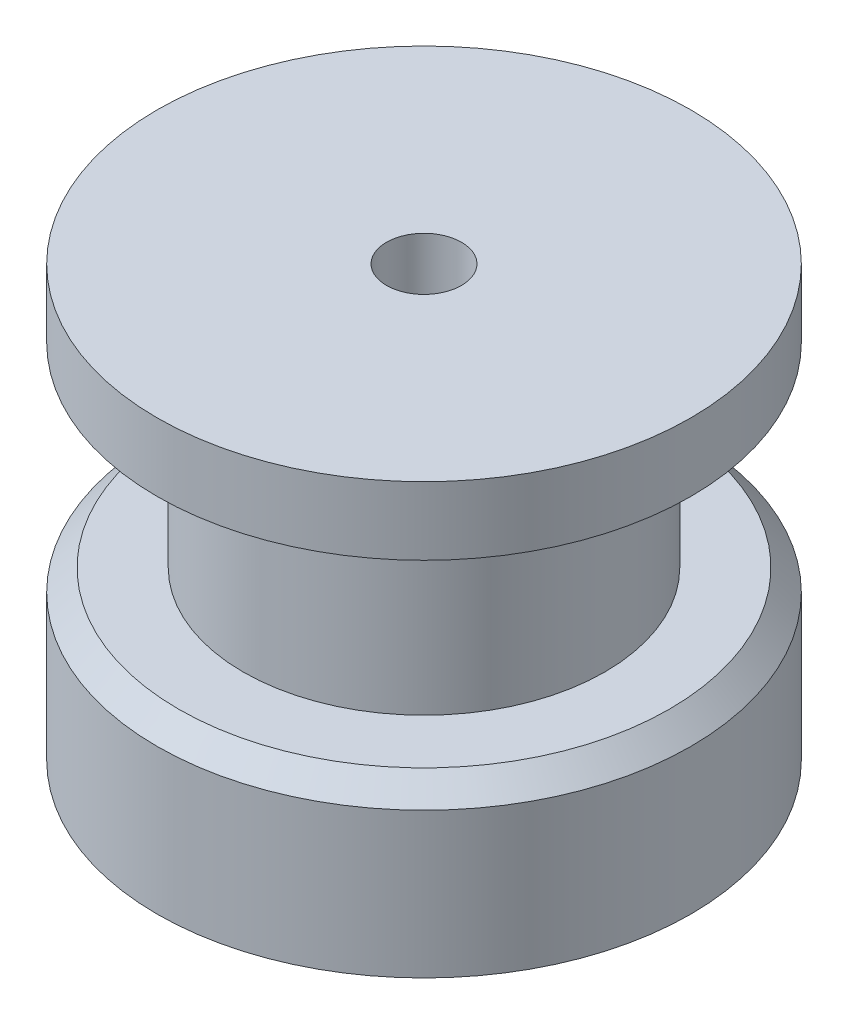
ISO-10303-21;
HEADER;
FILE_DESCRIPTION(('STEP AP214'),'2;1');
FILE_NAME('part.step','',(''),(''),'','','');
FILE_SCHEMA(('AUTOMOTIVE_DESIGN { 1 0 10303 214 1 1 1 1 }'));
ENDSEC;
DATA;
#1=APPLICATION_CONTEXT('core data for automotive mechanical design processes');
#2=APPLICATION_PROTOCOL_DEFINITION('international standard','automotive_design',2000,#1);
#3=PRODUCT_CONTEXT('',#1,'mechanical');
#4=PRODUCT('Part','Part','',(#3));
#5=PRODUCT_RELATED_PRODUCT_CATEGORY('part','',(#4));
#6=PRODUCT_DEFINITION_FORMATION('','',#4);
#7=PRODUCT_DEFINITION_CONTEXT('part definition',#1,'design');
#8=PRODUCT_DEFINITION('design','',#6,#7);
#9=PRODUCT_DEFINITION_SHAPE('','',#8);
#10=(LENGTH_UNIT() NAMED_UNIT(*) SI_UNIT(.MILLI.,.METRE.));
#11=(NAMED_UNIT(*) PLANE_ANGLE_UNIT() SI_UNIT($,.RADIAN.));
#12=(NAMED_UNIT(*) SI_UNIT($,.STERADIAN.) SOLID_ANGLE_UNIT());
#13=UNCERTAINTY_MEASURE_WITH_UNIT(LENGTH_MEASURE(1.E-05),#10,'distance_accuracy_value','');
#14=(GEOMETRIC_REPRESENTATION_CONTEXT(3) GLOBAL_UNCERTAINTY_ASSIGNED_CONTEXT((#13)) GLOBAL_UNIT_ASSIGNED_CONTEXT((#10,
#11,#12)) REPRESENTATION_CONTEXT('',''));
#15=CARTESIAN_POINT('',(0.,0.,0.));
#16=DIRECTION('',(0.,0.,1.));
#17=DIRECTION('',(1.,0.,0.));
#18=AXIS2_PLACEMENT_3D('',#15,#16,#17);
#19=CARTESIAN_POINT('',(0.,15.875,9.8552));
#20=DIRECTION('',(0.,-1.,0.));
#21=DIRECTION('',(0.,0.,-1.));
#22=AXIS2_PLACEMENT_3D('',#19,#20,#21);
#23=PLANE('',#22);
#24=CARTESIAN_POINT('',(0.,15.875,0.));
#25=DIRECTION('',(0.,-1.,0.));
#26=DIRECTION('',(0.,0.,-1.));
#27=AXIS2_PLACEMENT_3D('',#24,#25,#26);
#28=CIRCLE('',#27,9.8552);
#29=CARTESIAN_POINT('',(0.,15.875,-9.8552));
#30=VERTEX_POINT('',#29);
#31=EDGE_CURVE('E372',#30,#30,#28,.T.);
#32=ORIENTED_EDGE('',*,*,#31,.F.);
#33=EDGE_LOOP('',(#32));
#34=FACE_BOUND('',#33,.T.);
#35=CARTESIAN_POINT('',(0.,15.875,0.));
#36=DIRECTION('',(0.,-1.,0.));
#37=DIRECTION('',(0.,0.,-1.));
#38=AXIS2_PLACEMENT_3D('',#35,#36,#37);
#39=CIRCLE('',#38,1.3843);
#40=CARTESIAN_POINT('',(0.,15.875,-1.3843));
#41=VERTEX_POINT('',#40);
#42=EDGE_CURVE('E391',#41,#41,#39,.T.);
#43=ORIENTED_EDGE('',*,*,#42,.T.);
#44=EDGE_LOOP('',(#43));
#45=FACE_BOUND('',#44,.T.);
#46=ADVANCED_FACE('F362',(#34,#45),#23,.F.);
#47=CARTESIAN_POINT('',(0.,0.,0.));
#48=DIRECTION('',(0.,1.,0.));
#49=DIRECTION('',(0.,0.,1.));
#50=AXIS2_PLACEMENT_3D('',#47,#48,#49);
#51=PLANE('',#50);
#52=CARTESIAN_POINT('',(0.,0.,0.));
#53=DIRECTION('',(0.,-1.,0.));
#54=DIRECTION('',(0.,0.,-1.));
#55=AXIS2_PLACEMENT_3D('',#52,#53,#54);
#56=CIRCLE('',#55,9.8552);
#57=CARTESIAN_POINT('',(0.,0.,-9.8552));
#58=VERTEX_POINT('',#57);
#59=EDGE_CURVE('E387',#58,#58,#56,.T.);
#60=ORIENTED_EDGE('',*,*,#59,.T.);
#61=EDGE_LOOP('',(#60));
#62=FACE_BOUND('',#61,.T.);
#63=CARTESIAN_POINT('',(0.,0.,0.));
#64=DIRECTION('',(0.,1.,0.));
#65=DIRECTION('',(0.,0.,1.));
#66=AXIS2_PLACEMENT_3D('',#63,#64,#65);
#67=CIRCLE('',#66,1.3843);
#68=CARTESIAN_POINT('',(0.,0.,1.3843));
#69=VERTEX_POINT('',#68);
#70=EDGE_CURVE('E390',#69,#69,#67,.T.);
#71=ORIENTED_EDGE('',*,*,#70,.T.);
#72=EDGE_LOOP('',(#71));
#73=FACE_BOUND('',#72,.T.);
#74=ADVANCED_FACE('F397',(#62,#73),#51,.F.);
#75=CARTESIAN_POINT('',(0.,0.,0.));
#76=DIRECTION('',(0.,-1.,0.));
#77=DIRECTION('',(0.,0.,-1.));
#78=AXIS2_PLACEMENT_3D('',#75,#76,#77);
#79=CYLINDRICAL_SURFACE('',#78,9.8552);
#80=CARTESIAN_POINT('',(0.,13.3604,0.));
#81=DIRECTION('',(0.,-1.,0.));
#82=DIRECTION('',(0.,0.,-1.));
#83=AXIS2_PLACEMENT_3D('',#80,#81,#82);
#84=CIRCLE('',#83,9.8552);
#85=CARTESIAN_POINT('',(0.,13.3604,-9.8552));
#86=VERTEX_POINT('',#85);
#87=EDGE_CURVE('E376',#86,#86,#84,.T.);
#88=ORIENTED_EDGE('',*,*,#87,.F.);
#89=EDGE_LOOP('',(#88));
#90=FACE_BOUND('',#89,.T.);
#91=ORIENTED_EDGE('',*,*,#31,.T.);
#92=EDGE_LOOP('',(#91));
#93=FACE_BOUND('',#92,.T.);
#94=ADVANCED_FACE('F413',(#90,#93),#79,.T.);
#95=CARTESIAN_POINT('',(0.,13.3604,6.6802));
#96=DIRECTION('',(0.,1.,0.));
#97=DIRECTION('',(0.,0.,1.));
#98=AXIS2_PLACEMENT_3D('',#95,#96,#97);
#99=PLANE('',#98);
#100=CARTESIAN_POINT('',(0.,13.3604,0.));
#101=DIRECTION('',(0.,-1.,0.));
#102=DIRECTION('',(0.,0.,-1.));
#103=AXIS2_PLACEMENT_3D('',#100,#101,#102);
#104=CIRCLE('',#103,6.6802);
#105=CARTESIAN_POINT('',(0.,13.3604,-6.6802));
#106=VERTEX_POINT('',#105);
#107=EDGE_CURVE('E381',#106,#106,#104,.T.);
#108=ORIENTED_EDGE('',*,*,#107,.F.);
#109=EDGE_LOOP('',(#108));
#110=FACE_BOUND('',#109,.T.);
#111=ORIENTED_EDGE('',*,*,#87,.T.);
#112=EDGE_LOOP('',(#111));
#113=FACE_BOUND('',#112,.T.);
#114=ADVANCED_FACE('F419',(#110,#113),#99,.F.);
#115=CARTESIAN_POINT('',(0.,0.,0.));
#116=DIRECTION('',(0.,-1.,0.));
#117=DIRECTION('',(0.,0.,-1.));
#118=AXIS2_PLACEMENT_3D('',#115,#116,#117);
#119=CYLINDRICAL_SURFACE('',#118,6.6802);
#120=CARTESIAN_POINT('',(0.,6.1595,0.));
#121=DIRECTION('',(0.,-1.,0.));
#122=DIRECTION('',(0.,0.,-1.));
#123=AXIS2_PLACEMENT_3D('',#120,#121,#122);
#124=CIRCLE('',#123,6.6802);
#125=CARTESIAN_POINT('',(0.,6.1595,-6.6802));
#126=VERTEX_POINT('',#125);
#127=EDGE_CURVE('E384',#126,#126,#124,.T.);
#128=ORIENTED_EDGE('',*,*,#127,.F.);
#129=EDGE_LOOP('',(#128));
#130=FACE_BOUND('',#129,.T.);
#131=ORIENTED_EDGE('',*,*,#107,.T.);
#132=EDGE_LOOP('',(#131));
#133=FACE_BOUND('',#132,.T.);
#134=ADVANCED_FACE('F424',(#130,#133),#119,.T.);
#135=CARTESIAN_POINT('',(0.,6.1595,9.8552));
#136=DIRECTION('',(0.,-1.,0.));
#137=DIRECTION('',(0.,0.,-1.));
#138=AXIS2_PLACEMENT_3D('',#135,#136,#137);
#139=PLANE('',#138);
#140=CARTESIAN_POINT('',(0.,6.1595,0.));
#141=DIRECTION('',(0.,-1.,0.));
#142=DIRECTION('',(0.,0.,-1.));
#143=AXIS2_PLACEMENT_3D('',#140,#141,#142);
#144=CIRCLE('',#143,9.06145);
#145=CARTESIAN_POINT('',(0.,6.1595,-9.06145));
#146=VERTEX_POINT('',#145);
#147=EDGE_CURVE('E11',#146,#146,#144,.F.);
#148=ORIENTED_EDGE('',*,*,#147,.T.);
#149=EDGE_LOOP('',(#148));
#150=FACE_BOUND('',#149,.T.);
#151=ORIENTED_EDGE('',*,*,#127,.T.);
#152=EDGE_LOOP('',(#151));
#153=FACE_BOUND('',#152,.T.);
#154=ADVANCED_FACE('F430',(#150,#153),#139,.F.);
#155=CARTESIAN_POINT('',(0.,0.,0.));
#156=DIRECTION('',(0.,-1.,0.));
#157=DIRECTION('',(0.,0.,-1.));
#158=AXIS2_PLACEMENT_3D('',#155,#156,#157);
#159=CYLINDRICAL_SURFACE('',#158,9.8552);
#160=CARTESIAN_POINT('',(0.,5.36575,0.));
#161=DIRECTION('',(0.,-1.,0.));
#162=DIRECTION('',(0.,0.,-1.));
#163=AXIS2_PLACEMENT_3D('',#160,#161,#162);
#164=CIRCLE('',#163,9.8552);
#165=CARTESIAN_POINT('',(0.,5.36575,-9.8552));
#166=VERTEX_POINT('',#165);
#167=EDGE_CURVE('E368',#166,#166,#164,.T.);
#168=ORIENTED_EDGE('',*,*,#167,.T.);
#169=EDGE_LOOP('',(#168));
#170=FACE_BOUND('',#169,.T.);
#171=ORIENTED_EDGE('',*,*,#59,.F.);
#172=EDGE_LOOP('',(#171));
#173=FACE_BOUND('',#172,.T.);
#174=ADVANCED_FACE('F403',(#170,#173),#159,.T.);
#175=CARTESIAN_POINT('',(0.,15.876,0.));
#176=DIRECTION('',(0.,-1.,0.));
#177=DIRECTION('',(0.,0.,-1.));
#178=AXIS2_PLACEMENT_3D('',#175,#176,#177);
#179=CYLINDRICAL_SURFACE('',#178,1.3843);
#180=ORIENTED_EDGE('',*,*,#70,.F.);
#181=EDGE_LOOP('',(#180));
#182=FACE_BOUND('',#181,.T.);
#183=ORIENTED_EDGE('',*,*,#42,.F.);
#184=EDGE_LOOP('',(#183));
#185=FACE_BOUND('',#184,.T.);
#186=ADVANCED_FACE('F399',(#182,#185),#179,.F.);
#187=CARTESIAN_POINT('',(0.,5.36575,0.));
#188=DIRECTION('',(0.,-1.,0.));
#189=DIRECTION('',(0.,0.,-1.));
#190=AXIS2_PLACEMENT_3D('',#187,#188,#189);
#191=CONICAL_SURFACE('',#190,9.8552,0.785398163397449);
#192=ORIENTED_EDGE('',*,*,#147,.F.);
#193=EDGE_LOOP('',(#192));
#194=FACE_BOUND('',#193,.T.);
#195=ORIENTED_EDGE('',*,*,#167,.F.);
#196=EDGE_LOOP('',(#195));
#197=FACE_BOUND('',#196,.T.);
#198=ADVANCED_FACE('F402',(#194,#197),#191,.T.);
#199=CLOSED_SHELL('',(#46,#74,#94,#114,#134,#154,#174,#186,#198));
#200=MANIFOLD_SOLID_BREP('B2',#199);
#201=ADVANCED_BREP_SHAPE_REPRESENTATION('',(#18,#200),#14);
#202=SHAPE_DEFINITION_REPRESENTATION(#9,#201);
ENDSEC;
END-ISO-10303-21;
